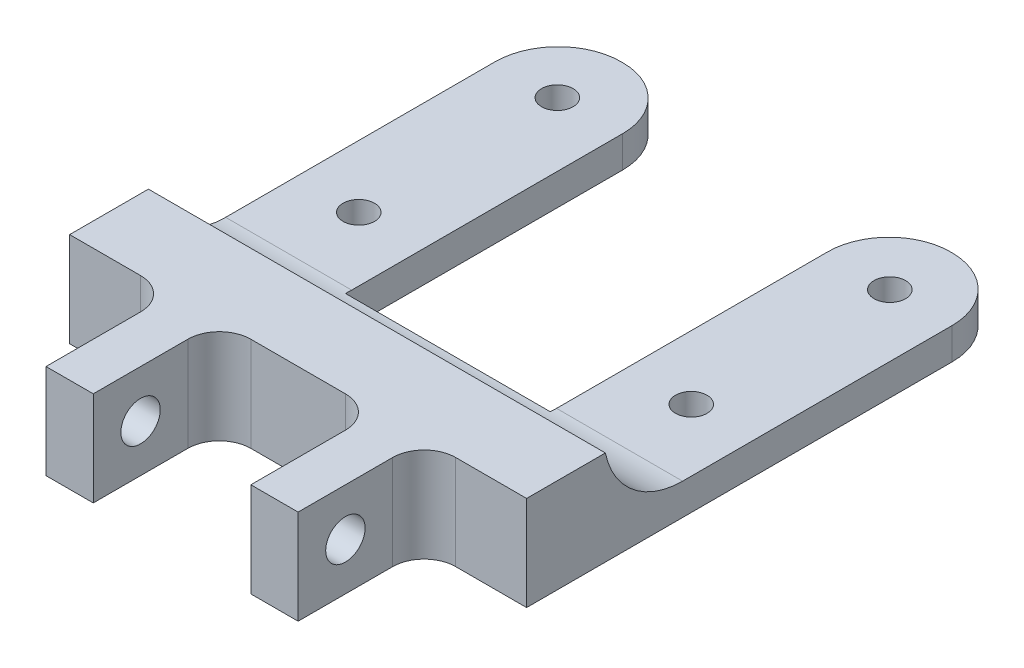
ISO-10303-21;
HEADER;
FILE_DESCRIPTION(('STEP AP214'),'2;1');
FILE_NAME('part.step','',(''),(''),'','','');
FILE_SCHEMA(('AUTOMOTIVE_DESIGN { 1 0 10303 214 1 1 1 1 }'));
ENDSEC;
DATA;
#1=APPLICATION_CONTEXT('core data for automotive mechanical design processes');
#2=APPLICATION_PROTOCOL_DEFINITION('international standard','automotive_design',2000,#1);
#3=PRODUCT_CONTEXT('',#1,'mechanical');
#4=PRODUCT('Part','Part','',(#3));
#5=PRODUCT_RELATED_PRODUCT_CATEGORY('part','',(#4));
#6=PRODUCT_DEFINITION_FORMATION('','',#4);
#7=PRODUCT_DEFINITION_CONTEXT('part definition',#1,'design');
#8=PRODUCT_DEFINITION('design','',#6,#7);
#9=PRODUCT_DEFINITION_SHAPE('','',#8);
#10=(LENGTH_UNIT() NAMED_UNIT(*) SI_UNIT(.MILLI.,.METRE.));
#11=(NAMED_UNIT(*) PLANE_ANGLE_UNIT() SI_UNIT($,.RADIAN.));
#12=(NAMED_UNIT(*) SI_UNIT($,.STERADIAN.) SOLID_ANGLE_UNIT());
#13=UNCERTAINTY_MEASURE_WITH_UNIT(LENGTH_MEASURE(1.E-05),#10,'distance_accuracy_value','');
#14=(GEOMETRIC_REPRESENTATION_CONTEXT(3) GLOBAL_UNCERTAINTY_ASSIGNED_CONTEXT((#13)) GLOBAL_UNIT_ASSIGNED_CONTEXT((#10,
#11,#12)) REPRESENTATION_CONTEXT('',''));
#15=CARTESIAN_POINT('',(0.,0.,0.));
#16=DIRECTION('',(0.,0.,1.));
#17=DIRECTION('',(1.,0.,0.));
#18=AXIS2_PLACEMENT_3D('',#15,#16,#17);
#19=CARTESIAN_POINT('',(0.,0.,5.));
#20=DIRECTION('',(0.,0.,1.));
#21=DIRECTION('',(1.,0.,0.));
#22=AXIS2_PLACEMENT_3D('',#19,#20,#21);
#23=PLANE('',#22);
#24=DIRECTION('',(1.,0.,0.));
#25=VECTOR('',#24,1.);
#26=CARTESIAN_POINT('',(0.,0.,5.));
#27=LINE('',#26,#25);
#28=CARTESIAN_POINT('',(11.5,0.,5.));
#29=VERTEX_POINT('',#28);
#30=CARTESIAN_POINT('',(17.5,0.,5.));
#31=VERTEX_POINT('',#30);
#32=EDGE_CURVE('E284',#29,#31,#27,.T.);
#33=ORIENTED_EDGE('',*,*,#32,.T.);
#34=DIRECTION('',(0.,-1.,0.));
#35=VECTOR('',#34,1.);
#36=CARTESIAN_POINT('',(17.5,0.,5.));
#37=LINE('',#36,#35);
#38=CARTESIAN_POINT('',(17.5,6.,5.));
#39=VERTEX_POINT('',#38);
#40=EDGE_CURVE('E412',#31,#39,#37,.F.);
#41=ORIENTED_EDGE('',*,*,#40,.T.);
#42=DIRECTION('',(1.,0.,0.));
#43=VECTOR('',#42,1.);
#44=CARTESIAN_POINT('',(0.,6.,5.));
#45=LINE('',#44,#43);
#46=CARTESIAN_POINT('',(11.5,6.,5.));
#47=VERTEX_POINT('',#46);
#48=EDGE_CURVE('E275',#47,#39,#45,.T.);
#49=ORIENTED_EDGE('',*,*,#48,.F.);
#50=DIRECTION('',(0.,1.,0.));
#51=VECTOR('',#50,1.);
#52=CARTESIAN_POINT('',(11.5,0.,5.));
#53=LINE('',#52,#51);
#54=EDGE_CURVE('E410',#47,#29,#53,.F.);
#55=ORIENTED_EDGE('',*,*,#54,.T.);
#56=EDGE_LOOP('',(#33,#41,#49,#55));
#57=FACE_BOUND('',#56,.T.);
#58=ADVANCED_FACE('F37',(#57),#23,.T.);
#59=CARTESIAN_POINT('',(24.5,6.,5.));
#60=VERTEX_POINT('',#59);
#61=CARTESIAN_POINT('',(29.,6.,5.));
#62=VERTEX_POINT('',#61);
#63=EDGE_CURVE('E271',#60,#62,#45,.T.);
#64=ORIENTED_EDGE('',*,*,#63,.F.);
#65=DIRECTION('',(0.,1.,0.));
#66=VECTOR('',#65,1.);
#67=CARTESIAN_POINT('',(24.5,0.,5.));
#68=LINE('',#67,#66);
#69=CARTESIAN_POINT('',(24.5,0.,5.));
#70=VERTEX_POINT('',#69);
#71=EDGE_CURVE('E417',#60,#70,#68,.F.);
#72=ORIENTED_EDGE('',*,*,#71,.T.);
#73=CARTESIAN_POINT('',(29.,0.,5.));
#74=VERTEX_POINT('',#73);
#75=EDGE_CURVE('E280',#70,#74,#27,.T.);
#76=ORIENTED_EDGE('',*,*,#75,.T.);
#77=DIRECTION('',(0.,1.,0.));
#78=VECTOR('',#77,1.);
#79=CARTESIAN_POINT('',(29.,0.,5.));
#80=LINE('',#79,#78);
#81=EDGE_CURVE('E285',#74,#62,#80,.T.);
#82=ORIENTED_EDGE('',*,*,#81,.T.);
#83=EDGE_LOOP('',(#64,#72,#76,#82));
#84=FACE_BOUND('',#83,.T.);
#85=ADVANCED_FACE('F465',(#84),#23,.T.);
#86=CARTESIAN_POINT('',(0.,2.,0.));
#87=DIRECTION('',(0.,1.,0.));
#88=DIRECTION('',(0.,0.,1.));
#89=AXIS2_PLACEMENT_3D('',#86,#87,#88);
#90=PLANE('',#89);
#91=CARTESIAN_POINT('',(3.95,2.,-22.));
#92=DIRECTION('',(0.,1.,0.));
#93=DIRECTION('',(0.,0.,1.));
#94=AXIS2_PLACEMENT_3D('',#91,#92,#93);
#95=CIRCLE('',#94,1.);
#96=CARTESIAN_POINT('',(3.95,2.,-21.));
#97=VERTEX_POINT('',#96);
#98=EDGE_CURVE('E327',#97,#97,#95,.T.);
#99=ORIENTED_EDGE('',*,*,#98,.F.);
#100=EDGE_LOOP('',(#99));
#101=FACE_BOUND('',#100,.T.);
#102=CARTESIAN_POINT('',(3.95,2.,-9.4));
#103=DIRECTION('',(0.,1.,0.));
#104=DIRECTION('',(0.,0.,1.));
#105=AXIS2_PLACEMENT_3D('',#102,#103,#104);
#106=CIRCLE('',#105,1.);
#107=CARTESIAN_POINT('',(3.95,2.,-8.4));
#108=VERTEX_POINT('',#107);
#109=EDGE_CURVE('E318',#108,#108,#106,.T.);
#110=ORIENTED_EDGE('',*,*,#109,.F.);
#111=EDGE_LOOP('',(#110));
#112=FACE_BOUND('',#111,.T.);
#113=DIRECTION('',(0.,0.,-1.));
#114=VECTOR('',#113,1.);
#115=CARTESIAN_POINT('',(0.,2.,0.));
#116=LINE('',#115,#114);
#117=CARTESIAN_POINT('',(0.,2.,-4.89897948556636));
#118=VERTEX_POINT('',#117);
#119=CARTESIAN_POINT('',(0.,2.,-22.));
#120=VERTEX_POINT('',#119);
#121=EDGE_CURVE('E300',#118,#120,#116,.T.);
#122=ORIENTED_EDGE('',*,*,#121,.F.);
#123=DIRECTION('',(-1.,0.,0.));
#124=VECTOR('',#123,1.);
#125=CARTESIAN_POINT('',(29.,2.,-4.89897948556636));
#126=LINE('',#125,#124);
#127=CARTESIAN_POINT('',(8.,2.,-4.89897948556636));
#128=VERTEX_POINT('',#127);
#129=EDGE_CURVE('E394',#118,#128,#126,.F.);
#130=ORIENTED_EDGE('',*,*,#129,.T.);
#131=DIRECTION('',(0.,0.,1.));
#132=VECTOR('',#131,1.);
#133=CARTESIAN_POINT('',(8.00000000000001,2.,0.));
#134=LINE('',#133,#132);
#135=CARTESIAN_POINT('',(8.,2.,-22.1));
#136=VERTEX_POINT('',#135);
#137=EDGE_CURVE('E315',#136,#128,#134,.T.);
#138=ORIENTED_EDGE('',*,*,#137,.F.);
#139=CARTESIAN_POINT('',(4.1,2.,-22.1));
#140=DIRECTION('',(0.,1.,0.));
#141=DIRECTION('',(0.,0.,1.));
#142=AXIS2_PLACEMENT_3D('',#139,#140,#141);
#143=CIRCLE('',#142,3.9);
#144=CARTESIAN_POINT('',(4.09999999999997,2.,-26.));
#145=VERTEX_POINT('',#144);
#146=EDGE_CURVE('E290',#145,#136,#143,.F.);
#147=ORIENTED_EDGE('',*,*,#146,.F.);
#148=DIRECTION('',(1.,0.,0.));
#149=VECTOR('',#148,1.);
#150=CARTESIAN_POINT('',(0.,2.,-26.));
#151=LINE('',#150,#149);
#152=CARTESIAN_POINT('',(4.00000000000003,2.,-26.));
#153=VERTEX_POINT('',#152);
#154=EDGE_CURVE('E293',#153,#145,#151,.T.);
#155=ORIENTED_EDGE('',*,*,#154,.F.);
#156=CARTESIAN_POINT('',(4.,2.,-22.));
#157=DIRECTION('',(0.,1.,0.));
#158=DIRECTION('',(0.,0.,1.));
#159=AXIS2_PLACEMENT_3D('',#156,#157,#158);
#160=CIRCLE('',#159,4.);
#161=EDGE_CURVE('E297',#120,#153,#160,.F.);
#162=ORIENTED_EDGE('',*,*,#161,.F.);
#163=EDGE_LOOP('',(#122,#130,#138,#147,#155,#162));
#164=FACE_BOUND('',#163,.T.);
#165=ADVANCED_FACE('F511',(#101,#112,#164),#90,.T.);
#166=CARTESIAN_POINT('',(4.1,2.,-22.1));
#167=DIRECTION('',(0.,-1.,0.));
#168=DIRECTION('',(0.,0.,-1.));
#169=AXIS2_PLACEMENT_3D('',#166,#167,#168);
#170=CYLINDRICAL_SURFACE('',#169,3.9);
#171=CARTESIAN_POINT('',(4.1,0.,-22.1));
#172=DIRECTION('',(0.,1.,0.));
#173=DIRECTION('',(0.,0.,1.));
#174=AXIS2_PLACEMENT_3D('',#171,#172,#173);
#175=CIRCLE('',#174,3.9);
#176=CARTESIAN_POINT('',(4.09999999999997,0.,-26.));
#177=VERTEX_POINT('',#176);
#178=CARTESIAN_POINT('',(8.,0.,-22.1));
#179=VERTEX_POINT('',#178);
#180=EDGE_CURVE('E288',#177,#179,#175,.F.);
#181=ORIENTED_EDGE('',*,*,#180,.F.);
#182=DIRECTION('',(0.,-1.,0.));
#183=VECTOR('',#182,1.);
#184=CARTESIAN_POINT('',(4.09999999999997,2.,-26.));
#185=LINE('',#184,#183);
#186=EDGE_CURVE('E390',#145,#177,#185,.T.);
#187=ORIENTED_EDGE('',*,*,#186,.F.);
#188=ORIENTED_EDGE('',*,*,#146,.T.);
#189=DIRECTION('',(0.,-1.,0.));
#190=VECTOR('',#189,1.);
#191=CARTESIAN_POINT('',(8.,2.,-22.1));
#192=LINE('',#191,#190);
#193=EDGE_CURVE('E330',#136,#179,#192,.T.);
#194=ORIENTED_EDGE('',*,*,#193,.T.);
#195=EDGE_LOOP('',(#181,#187,#188,#194));
#196=FACE_BOUND('',#195,.T.);
#197=ADVANCED_FACE('F577',(#196),#170,.T.);
#198=CARTESIAN_POINT('',(0.,2.,-26.));
#199=DIRECTION('',(0.,0.,-1.));
#200=DIRECTION('',(-1.,0.,0.));
#201=AXIS2_PLACEMENT_3D('',#198,#199,#200);
#202=PLANE('',#201);
#203=DIRECTION('',(1.,0.,0.));
#204=VECTOR('',#203,1.);
#205=CARTESIAN_POINT('',(0.,0.,-26.));
#206=LINE('',#205,#204);
#207=CARTESIAN_POINT('',(4.00000000000003,0.,-26.));
#208=VERTEX_POINT('',#207);
#209=EDGE_CURVE('E332',#208,#177,#206,.T.);
#210=ORIENTED_EDGE('',*,*,#209,.F.);
#211=DIRECTION('',(0.,-1.,0.));
#212=VECTOR('',#211,1.);
#213=CARTESIAN_POINT('',(4.00000000000003,2.,-26.));
#214=LINE('',#213,#212);
#215=EDGE_CURVE('E388',#153,#208,#214,.T.);
#216=ORIENTED_EDGE('',*,*,#215,.F.);
#217=ORIENTED_EDGE('',*,*,#154,.T.);
#218=ORIENTED_EDGE('',*,*,#186,.T.);
#219=EDGE_LOOP('',(#210,#216,#217,#218));
#220=FACE_BOUND('',#219,.T.);
#221=ADVANCED_FACE('F573',(#220),#202,.T.);
#222=CARTESIAN_POINT('',(4.,2.,-22.));
#223=DIRECTION('',(0.,-1.,0.));
#224=DIRECTION('',(0.,0.,-1.));
#225=AXIS2_PLACEMENT_3D('',#222,#223,#224);
#226=CYLINDRICAL_SURFACE('',#225,4.);
#227=CARTESIAN_POINT('',(4.,0.,-22.));
#228=DIRECTION('',(0.,1.,0.));
#229=DIRECTION('',(0.,0.,1.));
#230=AXIS2_PLACEMENT_3D('',#227,#228,#229);
#231=CIRCLE('',#230,4.);
#232=CARTESIAN_POINT('',(0.,0.,-22.));
#233=VERTEX_POINT('',#232);
#234=EDGE_CURVE('E335',#233,#208,#231,.F.);
#235=ORIENTED_EDGE('',*,*,#234,.F.);
#236=DIRECTION('',(0.,-1.,0.));
#237=VECTOR('',#236,1.);
#238=CARTESIAN_POINT('',(0.,2.,-22.));
#239=LINE('',#238,#237);
#240=EDGE_CURVE('E386',#120,#233,#239,.T.);
#241=ORIENTED_EDGE('',*,*,#240,.F.);
#242=ORIENTED_EDGE('',*,*,#161,.T.);
#243=ORIENTED_EDGE('',*,*,#215,.T.);
#244=EDGE_LOOP('',(#235,#241,#242,#243));
#245=FACE_BOUND('',#244,.T.);
#246=ADVANCED_FACE('F570',(#245),#226,.T.);
#247=CARTESIAN_POINT('',(0.,2.,0.));
#248=DIRECTION('',(-1.,0.,0.));
#249=DIRECTION('',(0.,0.,1.));
#250=AXIS2_PLACEMENT_3D('',#247,#248,#249);
#251=PLANE('',#250);
#252=DIRECTION('',(0.,0.,-1.));
#253=VECTOR('',#252,1.);
#254=CARTESIAN_POINT('',(0.,0.,0.));
#255=LINE('',#254,#253);
#256=CARTESIAN_POINT('',(0.,0.,5.));
#257=VERTEX_POINT('',#256);
#258=EDGE_CURVE('E338',#257,#233,#255,.T.);
#259=ORIENTED_EDGE('',*,*,#258,.F.);
#260=DIRECTION('',(0.,1.,0.));
#261=VECTOR('',#260,1.);
#262=CARTESIAN_POINT('',(0.,0.,5.));
#263=LINE('',#262,#261);
#264=CARTESIAN_POINT('',(0.,6.,5.));
#265=VERTEX_POINT('',#264);
#266=EDGE_CURVE('E283',#257,#265,#263,.T.);
#267=ORIENTED_EDGE('',*,*,#266,.T.);
#268=DIRECTION('',(0.,0.,1.));
#269=VECTOR('',#268,1.);
#270=CARTESIAN_POINT('',(0.,6.,0.));
#271=LINE('',#270,#269);
#272=CARTESIAN_POINT('',(0.,6.,0.));
#273=VERTEX_POINT('',#272);
#274=EDGE_CURVE('E268',#273,#265,#271,.T.);
#275=ORIENTED_EDGE('',*,*,#274,.F.);
#276=CARTESIAN_POINT('',(0.,7.,-4.89897948556636));
#277=DIRECTION('',(-1.,0.,0.));
#278=DIRECTION('',(0.,0.,1.));
#279=AXIS2_PLACEMENT_3D('',#276,#277,#278);
#280=CIRCLE('',#279,5.);
#281=EDGE_CURVE('E407',#273,#118,#280,.F.);
#282=ORIENTED_EDGE('',*,*,#281,.T.);
#283=ORIENTED_EDGE('',*,*,#121,.T.);
#284=ORIENTED_EDGE('',*,*,#240,.T.);
#285=EDGE_LOOP('',(#259,#267,#275,#282,#283,#284));
#286=FACE_BOUND('',#285,.T.);
#287=ADVANCED_FACE('F481',(#286),#251,.T.);
#288=CARTESIAN_POINT('',(29.,2.,0.));
#289=DIRECTION('',(-1.,0.,0.));
#290=DIRECTION('',(0.,0.,1.));
#291=AXIS2_PLACEMENT_3D('',#288,#289,#290);
#292=PLANE('',#291);
#293=DIRECTION('',(0.,0.,-1.));
#294=VECTOR('',#293,1.);
#295=CARTESIAN_POINT('',(29.,0.,0.));
#296=LINE('',#295,#294);
#297=CARTESIAN_POINT('',(29.,0.,-22.));
#298=VERTEX_POINT('',#297);
#299=EDGE_CURVE('E341',#74,#298,#296,.T.);
#300=ORIENTED_EDGE('',*,*,#299,.T.);
#301=DIRECTION('',(0.,-1.,0.));
#302=VECTOR('',#301,1.);
#303=CARTESIAN_POINT('',(29.,2.,-22.));
#304=LINE('',#303,#302);
#305=CARTESIAN_POINT('',(29.,2.,-22.));
#306=VERTEX_POINT('',#305);
#307=EDGE_CURVE('E384',#306,#298,#304,.T.);
#308=ORIENTED_EDGE('',*,*,#307,.F.);
#309=DIRECTION('',(0.,0.,-1.));
#310=VECTOR('',#309,1.);
#311=CARTESIAN_POINT('',(29.,2.,0.));
#312=LINE('',#311,#310);
#313=CARTESIAN_POINT('',(29.,2.,-4.89897948556636));
#314=VERTEX_POINT('',#313);
#315=EDGE_CURVE('E302',#314,#306,#312,.T.);
#316=ORIENTED_EDGE('',*,*,#315,.F.);
#317=CARTESIAN_POINT('',(29.,7.,-4.89897948556636));
#318=DIRECTION('',(-1.,0.,0.));
#319=DIRECTION('',(0.,0.,1.));
#320=AXIS2_PLACEMENT_3D('',#317,#318,#319);
#321=CIRCLE('',#320,5.);
#322=CARTESIAN_POINT('',(29.,6.,0.));
#323=VERTEX_POINT('',#322);
#324=EDGE_CURVE('E405',#314,#323,#321,.T.);
#325=ORIENTED_EDGE('',*,*,#324,.T.);
#326=DIRECTION('',(0.,0.,-1.));
#327=VECTOR('',#326,1.);
#328=CARTESIAN_POINT('',(29.,6.,0.));
#329=LINE('',#328,#327);
#330=EDGE_CURVE('E274',#62,#323,#329,.T.);
#331=ORIENTED_EDGE('',*,*,#330,.F.);
#332=ORIENTED_EDGE('',*,*,#81,.F.);
#333=EDGE_LOOP('',(#300,#308,#316,#325,#331,#332));
#334=FACE_BOUND('',#333,.T.);
#335=ADVANCED_FACE('F469',(#334),#292,.F.);
#336=CARTESIAN_POINT('',(25.,2.,-22.));
#337=DIRECTION('',(0.,-1.,0.));
#338=DIRECTION('',(0.,0.,-1.));
#339=AXIS2_PLACEMENT_3D('',#336,#337,#338);
#340=CYLINDRICAL_SURFACE('',#339,4.);
#341=CARTESIAN_POINT('',(25.,0.,-22.));
#342=DIRECTION('',(0.,1.,0.));
#343=DIRECTION('',(0.,0.,1.));
#344=AXIS2_PLACEMENT_3D('',#341,#342,#343);
#345=CIRCLE('',#344,4.);
#346=CARTESIAN_POINT('',(25.,0.,-26.));
#347=VERTEX_POINT('',#346);
#348=EDGE_CURVE('E344',#347,#298,#345,.F.);
#349=ORIENTED_EDGE('',*,*,#348,.F.);
#350=DIRECTION('',(0.,-1.,0.));
#351=VECTOR('',#350,1.);
#352=CARTESIAN_POINT('',(25.,2.,-26.));
#353=LINE('',#352,#351);
#354=CARTESIAN_POINT('',(25.,2.,-26.));
#355=VERTEX_POINT('',#354);
#356=EDGE_CURVE('E382',#355,#347,#353,.T.);
#357=ORIENTED_EDGE('',*,*,#356,.F.);
#358=CARTESIAN_POINT('',(25.,2.,-22.));
#359=DIRECTION('',(0.,1.,0.));
#360=DIRECTION('',(0.,0.,1.));
#361=AXIS2_PLACEMENT_3D('',#358,#359,#360);
#362=CIRCLE('',#361,4.);
#363=EDGE_CURVE('E304',#355,#306,#362,.F.);
#364=ORIENTED_EDGE('',*,*,#363,.T.);
#365=ORIENTED_EDGE('',*,*,#307,.T.);
#366=EDGE_LOOP('',(#349,#357,#364,#365));
#367=FACE_BOUND('',#366,.T.);
#368=ADVANCED_FACE('F561',(#367),#340,.T.);
#369=CARTESIAN_POINT('',(0.,2.,-26.));
#370=DIRECTION('',(0.,0.,-1.));
#371=DIRECTION('',(-1.,0.,0.));
#372=AXIS2_PLACEMENT_3D('',#369,#370,#371);
#373=PLANE('',#372);
#374=DIRECTION('',(1.,0.,0.));
#375=VECTOR('',#374,1.);
#376=CARTESIAN_POINT('',(0.,0.,-26.));
#377=LINE('',#376,#375);
#378=CARTESIAN_POINT('',(24.9,0.,-26.));
#379=VERTEX_POINT('',#378);
#380=EDGE_CURVE('E347',#379,#347,#377,.T.);
#381=ORIENTED_EDGE('',*,*,#380,.F.);
#382=DIRECTION('',(0.,-1.,0.));
#383=VECTOR('',#382,1.);
#384=CARTESIAN_POINT('',(24.9,2.,-26.));
#385=LINE('',#384,#383);
#386=CARTESIAN_POINT('',(24.9,2.,-26.));
#387=VERTEX_POINT('',#386);
#388=EDGE_CURVE('E380',#387,#379,#385,.T.);
#389=ORIENTED_EDGE('',*,*,#388,.F.);
#390=DIRECTION('',(1.,0.,0.));
#391=VECTOR('',#390,1.);
#392=CARTESIAN_POINT('',(0.,2.,-26.));
#393=LINE('',#392,#391);
#394=EDGE_CURVE('E307',#387,#355,#393,.T.);
#395=ORIENTED_EDGE('',*,*,#394,.T.);
#396=ORIENTED_EDGE('',*,*,#356,.T.);
#397=EDGE_LOOP('',(#381,#389,#395,#396));
#398=FACE_BOUND('',#397,.T.);
#399=ADVANCED_FACE('F557',(#398),#373,.T.);
#400=CARTESIAN_POINT('',(24.9,2.,-22.1));
#401=DIRECTION('',(0.,-1.,0.));
#402=DIRECTION('',(0.,0.,-1.));
#403=AXIS2_PLACEMENT_3D('',#400,#401,#402);
#404=CYLINDRICAL_SURFACE('',#403,3.9);
#405=CARTESIAN_POINT('',(24.9,0.,-22.1));
#406=DIRECTION('',(0.,1.,0.));
#407=DIRECTION('',(0.,0.,1.));
#408=AXIS2_PLACEMENT_3D('',#405,#406,#407);
#409=CIRCLE('',#408,3.9);
#410=CARTESIAN_POINT('',(21.,0.,-22.1));
#411=VERTEX_POINT('',#410);
#412=EDGE_CURVE('E350',#379,#411,#409,.T.);
#413=ORIENTED_EDGE('',*,*,#412,.T.);
#414=DIRECTION('',(0.,-1.,0.));
#415=VECTOR('',#414,1.);
#416=CARTESIAN_POINT('',(21.,2.,-22.1));
#417=LINE('',#416,#415);
#418=CARTESIAN_POINT('',(21.,2.,-22.1));
#419=VERTEX_POINT('',#418);
#420=EDGE_CURVE('E377',#419,#411,#417,.T.);
#421=ORIENTED_EDGE('',*,*,#420,.F.);
#422=CARTESIAN_POINT('',(24.9,2.,-22.1));
#423=DIRECTION('',(0.,1.,0.));
#424=DIRECTION('',(0.,0.,1.));
#425=AXIS2_PLACEMENT_3D('',#422,#423,#424);
#426=CIRCLE('',#425,3.9);
#427=EDGE_CURVE('E310',#387,#419,#426,.T.);
#428=ORIENTED_EDGE('',*,*,#427,.F.);
#429=ORIENTED_EDGE('',*,*,#388,.T.);
#430=EDGE_LOOP('',(#413,#421,#428,#429));
#431=FACE_BOUND('',#430,.T.);
#432=ADVANCED_FACE('F553',(#431),#404,.T.);
#433=CARTESIAN_POINT('',(21.,2.,0.));
#434=DIRECTION('',(1.,0.,0.));
#435=DIRECTION('',(0.,0.,-1.));
#436=AXIS2_PLACEMENT_3D('',#433,#434,#435);
#437=PLANE('',#436);
#438=DIRECTION('',(0.,0.,1.));
#439=VECTOR('',#438,1.);
#440=CARTESIAN_POINT('',(21.,0.,0.));
#441=LINE('',#440,#439);
#442=CARTESIAN_POINT('',(21.,0.,-4.5));
#443=VERTEX_POINT('',#442);
#444=EDGE_CURVE('E352',#411,#443,#441,.T.);
#445=ORIENTED_EDGE('',*,*,#444,.T.);
#446=DIRECTION('',(0.,-1.,0.));
#447=VECTOR('',#446,1.);
#448=CARTESIAN_POINT('',(21.,2.,-4.5));
#449=LINE('',#448,#447);
#450=CARTESIAN_POINT('',(21.,2.01594388373313,-4.5));
#451=VERTEX_POINT('',#450);
#452=EDGE_CURVE('E375',#451,#443,#449,.T.);
#453=ORIENTED_EDGE('',*,*,#452,.F.);
#454=CARTESIAN_POINT('',(21.,7.,-4.89897948556636));
#455=DIRECTION('',(1.,0.,0.));
#456=DIRECTION('',(0.,0.,-1.));
#457=AXIS2_PLACEMENT_3D('',#454,#455,#456);
#458=CIRCLE('',#457,5.);
#459=CARTESIAN_POINT('',(21.,2.,-4.89897948556636));
#460=VERTEX_POINT('',#459);
#461=EDGE_CURVE('E403',#451,#460,#458,.T.);
#462=ORIENTED_EDGE('',*,*,#461,.T.);
#463=DIRECTION('',(0.,0.,1.));
#464=VECTOR('',#463,1.);
#465=CARTESIAN_POINT('',(21.,2.,0.));
#466=LINE('',#465,#464);
#467=EDGE_CURVE('E312',#419,#460,#466,.T.);
#468=ORIENTED_EDGE('',*,*,#467,.F.);
#469=ORIENTED_EDGE('',*,*,#420,.T.);
#470=EDGE_LOOP('',(#445,#453,#462,#468,#469));
#471=FACE_BOUND('',#470,.T.);
#472=ADVANCED_FACE('F549',(#471),#437,.F.);
#473=CARTESIAN_POINT('',(0.,2.,-4.5));
#474=DIRECTION('',(0.,0.,-1.));
#475=DIRECTION('',(-1.,0.,0.));
#476=AXIS2_PLACEMENT_3D('',#473,#474,#475);
#477=PLANE('',#476);
#478=DIRECTION('',(1.,0.,0.));
#479=VECTOR('',#478,1.);
#480=CARTESIAN_POINT('',(0.,0.,-4.5));
#481=LINE('',#480,#479);
#482=CARTESIAN_POINT('',(8.,0.,-4.5));
#483=VERTEX_POINT('',#482);
#484=EDGE_CURVE('E355',#483,#443,#481,.T.);
#485=ORIENTED_EDGE('',*,*,#484,.F.);
#486=DIRECTION('',(0.,-1.,0.));
#487=VECTOR('',#486,1.);
#488=CARTESIAN_POINT('',(8.,2.,-4.5));
#489=LINE('',#488,#487);
#490=CARTESIAN_POINT('',(8.,2.01594388373313,-4.5));
#491=VERTEX_POINT('',#490);
#492=EDGE_CURVE('E373',#491,#483,#489,.T.);
#493=ORIENTED_EDGE('',*,*,#492,.F.);
#494=DIRECTION('',(1.,0.,0.));
#495=VECTOR('',#494,1.);
#496=CARTESIAN_POINT('',(8.,2.01594388373313,-4.5));
#497=LINE('',#496,#495);
#498=EDGE_CURVE('E400',#491,#451,#497,.T.);
#499=ORIENTED_EDGE('',*,*,#498,.T.);
#500=ORIENTED_EDGE('',*,*,#452,.T.);
#501=EDGE_LOOP('',(#485,#493,#499,#500));
#502=FACE_BOUND('',#501,.T.);
#503=ADVANCED_FACE('F535',(#502),#477,.T.);
#504=CARTESIAN_POINT('',(25.05,2.,-22.));
#505=DIRECTION('',(0.,-1.,0.));
#506=DIRECTION('',(0.,0.,-1.));
#507=AXIS2_PLACEMENT_3D('',#504,#505,#506);
#508=CYLINDRICAL_SURFACE('',#507,1.);
#509=CARTESIAN_POINT('',(25.05,2.,-22.));
#510=DIRECTION('',(0.,1.,0.));
#511=DIRECTION('',(0.,0.,1.));
#512=AXIS2_PLACEMENT_3D('',#509,#510,#511);
#513=CIRCLE('',#512,1.);
#514=CARTESIAN_POINT('',(25.05,2.,-21.));
#515=VERTEX_POINT('',#514);
#516=EDGE_CURVE('E324',#515,#515,#513,.T.);
#517=ORIENTED_EDGE('',*,*,#516,.T.);
#518=EDGE_LOOP('',(#517));
#519=FACE_BOUND('',#518,.T.);
#520=CARTESIAN_POINT('',(25.05,0.,-22.));
#521=DIRECTION('',(0.,1.,0.));
#522=DIRECTION('',(0.,0.,1.));
#523=AXIS2_PLACEMENT_3D('',#520,#521,#522);
#524=CIRCLE('',#523,1.);
#525=CARTESIAN_POINT('',(25.05,0.,-21.));
#526=VERTEX_POINT('',#525);
#527=EDGE_CURVE('E367',#526,#526,#524,.T.);
#528=ORIENTED_EDGE('',*,*,#527,.F.);
#529=EDGE_LOOP('',(#528));
#530=FACE_BOUND('',#529,.T.);
#531=ADVANCED_FACE('F531',(#519,#530),#508,.F.);
#532=CARTESIAN_POINT('',(25.05,2.,-9.4));
#533=DIRECTION('',(0.,-1.,0.));
#534=DIRECTION('',(0.,0.,-1.));
#535=AXIS2_PLACEMENT_3D('',#532,#533,#534);
#536=CYLINDRICAL_SURFACE('',#535,1.);
#537=CARTESIAN_POINT('',(25.05,2.,-9.4));
#538=DIRECTION('',(0.,1.,0.));
#539=DIRECTION('',(0.,0.,1.));
#540=AXIS2_PLACEMENT_3D('',#537,#538,#539);
#541=CIRCLE('',#540,1.);
#542=CARTESIAN_POINT('',(25.05,2.,-8.4));
#543=VERTEX_POINT('',#542);
#544=EDGE_CURVE('E321',#543,#543,#541,.T.);
#545=ORIENTED_EDGE('',*,*,#544,.T.);
#546=EDGE_LOOP('',(#545));
#547=FACE_BOUND('',#546,.T.);
#548=CARTESIAN_POINT('',(25.05,0.,-9.4));
#549=DIRECTION('',(0.,1.,0.));
#550=DIRECTION('',(0.,0.,1.));
#551=AXIS2_PLACEMENT_3D('',#548,#549,#550);
#552=CIRCLE('',#551,1.);
#553=CARTESIAN_POINT('',(25.05,0.,-8.4));
#554=VERTEX_POINT('',#553);
#555=EDGE_CURVE('E364',#554,#554,#552,.T.);
#556=ORIENTED_EDGE('',*,*,#555,.F.);
#557=EDGE_LOOP('',(#556));
#558=FACE_BOUND('',#557,.T.);
#559=ADVANCED_FACE('F534',(#547,#558),#536,.F.);
#560=CARTESIAN_POINT('',(3.95,2.,-9.4));
#561=DIRECTION('',(0.,-1.,0.));
#562=DIRECTION('',(0.,0.,-1.));
#563=AXIS2_PLACEMENT_3D('',#560,#561,#562);
#564=CYLINDRICAL_SURFACE('',#563,1.);
#565=ORIENTED_EDGE('',*,*,#109,.T.);
#566=EDGE_LOOP('',(#565));
#567=FACE_BOUND('',#566,.T.);
#568=CARTESIAN_POINT('',(3.95,0.,-9.4));
#569=DIRECTION('',(0.,1.,0.));
#570=DIRECTION('',(0.,0.,1.));
#571=AXIS2_PLACEMENT_3D('',#568,#569,#570);
#572=CIRCLE('',#571,1.);
#573=CARTESIAN_POINT('',(3.95,0.,-8.4));
#574=VERTEX_POINT('',#573);
#575=EDGE_CURVE('E361',#574,#574,#572,.T.);
#576=ORIENTED_EDGE('',*,*,#575,.F.);
#577=EDGE_LOOP('',(#576));
#578=FACE_BOUND('',#577,.T.);
#579=ADVANCED_FACE('F539',(#567,#578),#564,.F.);
#580=CARTESIAN_POINT('',(8.00000000000001,2.,0.));
#581=DIRECTION('',(1.,0.,0.));
#582=DIRECTION('',(0.,0.,-1.));
#583=AXIS2_PLACEMENT_3D('',#580,#581,#582);
#584=PLANE('',#583);
#585=DIRECTION('',(0.,0.,1.));
#586=VECTOR('',#585,1.);
#587=CARTESIAN_POINT('',(8.00000000000001,0.,0.));
#588=LINE('',#587,#586);
#589=EDGE_CURVE('E358',#179,#483,#588,.T.);
#590=ORIENTED_EDGE('',*,*,#589,.F.);
#591=ORIENTED_EDGE('',*,*,#193,.F.);
#592=ORIENTED_EDGE('',*,*,#137,.T.);
#593=CARTESIAN_POINT('',(8.,7.,-4.89897948556636));
#594=DIRECTION('',(1.,0.,0.));
#595=DIRECTION('',(0.,0.,-1.));
#596=AXIS2_PLACEMENT_3D('',#593,#594,#595);
#597=CIRCLE('',#596,5.);
#598=EDGE_CURVE('E397',#128,#491,#597,.F.);
#599=ORIENTED_EDGE('',*,*,#598,.T.);
#600=ORIENTED_EDGE('',*,*,#492,.T.);
#601=EDGE_LOOP('',(#590,#591,#592,#599,#600));
#602=FACE_BOUND('',#601,.T.);
#603=ADVANCED_FACE('F529',(#602),#584,.T.);
#604=CARTESIAN_POINT('',(3.95,2.,-22.));
#605=DIRECTION('',(0.,-1.,0.));
#606=DIRECTION('',(0.,0.,-1.));
#607=AXIS2_PLACEMENT_3D('',#604,#605,#606);
#608=CYLINDRICAL_SURFACE('',#607,1.);
#609=ORIENTED_EDGE('',*,*,#98,.T.);
#610=EDGE_LOOP('',(#609));
#611=FACE_BOUND('',#610,.T.);
#612=CARTESIAN_POINT('',(3.95,0.,-22.));
#613=DIRECTION('',(0.,1.,0.));
#614=DIRECTION('',(0.,0.,1.));
#615=AXIS2_PLACEMENT_3D('',#612,#613,#614);
#616=CIRCLE('',#615,1.);
#617=CARTESIAN_POINT('',(3.95,0.,-21.));
#618=VERTEX_POINT('',#617);
#619=EDGE_CURVE('E294',#618,#618,#616,.T.);
#620=ORIENTED_EDGE('',*,*,#619,.F.);
#621=EDGE_LOOP('',(#620));
#622=FACE_BOUND('',#621,.T.);
#623=ADVANCED_FACE('F524',(#611,#622),#608,.F.);
#624=ORIENTED_EDGE('',*,*,#467,.T.);
#625=DIRECTION('',(-1.,0.,0.));
#626=VECTOR('',#625,1.);
#627=CARTESIAN_POINT('',(29.,2.,-4.89897948556636));
#628=LINE('',#627,#626);
#629=EDGE_CURVE('E392',#460,#314,#628,.F.);
#630=ORIENTED_EDGE('',*,*,#629,.T.);
#631=ORIENTED_EDGE('',*,*,#315,.T.);
#632=ORIENTED_EDGE('',*,*,#363,.F.);
#633=ORIENTED_EDGE('',*,*,#394,.F.);
#634=ORIENTED_EDGE('',*,*,#427,.T.);
#635=EDGE_LOOP('',(#624,#630,#631,#632,#633,#634));
#636=FACE_BOUND('',#635,.T.);
#637=ORIENTED_EDGE('',*,*,#544,.F.);
#638=EDGE_LOOP('',(#637));
#639=FACE_BOUND('',#638,.T.);
#640=ORIENTED_EDGE('',*,*,#516,.F.);
#641=EDGE_LOOP('',(#640));
#642=FACE_BOUND('',#641,.T.);
#643=ADVANCED_FACE('F519',(#636,#639,#642),#90,.T.);
#644=CARTESIAN_POINT('',(0.,0.,0.));
#645=DIRECTION('',(0.,1.,0.));
#646=DIRECTION('',(0.,0.,1.));
#647=AXIS2_PLACEMENT_3D('',#644,#645,#646);
#648=PLANE('',#647);
#649=ORIENTED_EDGE('',*,*,#180,.T.);
#650=ORIENTED_EDGE('',*,*,#589,.T.);
#651=ORIENTED_EDGE('',*,*,#484,.T.);
#652=ORIENTED_EDGE('',*,*,#444,.F.);
#653=ORIENTED_EDGE('',*,*,#412,.F.);
#654=ORIENTED_EDGE('',*,*,#380,.T.);
#655=ORIENTED_EDGE('',*,*,#348,.T.);
#656=ORIENTED_EDGE('',*,*,#299,.F.);
#657=ORIENTED_EDGE('',*,*,#75,.F.);
#658=CARTESIAN_POINT('',(24.5,0.,7.));
#659=DIRECTION('',(0.,1.,0.));
#660=DIRECTION('',(0.,0.,1.));
#661=AXIS2_PLACEMENT_3D('',#658,#659,#660);
#662=CIRCLE('',#661,2.);
#663=CARTESIAN_POINT('',(22.5,0.,7.));
#664=VERTEX_POINT('',#663);
#665=EDGE_CURVE('E432',#70,#664,#662,.T.);
#666=ORIENTED_EDGE('',*,*,#665,.T.);
#667=DIRECTION('',(0.,0.,-1.));
#668=VECTOR('',#667,1.);
#669=CARTESIAN_POINT('',(22.5,0.,13.));
#670=LINE('',#669,#668);
#671=CARTESIAN_POINT('',(22.5,0.,13.));
#672=VERTEX_POINT('',#671);
#673=EDGE_CURVE('E224',#672,#664,#670,.T.);
#674=ORIENTED_EDGE('',*,*,#673,.F.);
#675=DIRECTION('',(1.,0.,0.));
#676=VECTOR('',#675,1.);
#677=CARTESIAN_POINT('',(19.5,0.,13.));
#678=LINE('',#677,#676);
#679=CARTESIAN_POINT('',(19.5,0.,13.));
#680=VERTEX_POINT('',#679);
#681=EDGE_CURVE('E216',#680,#672,#678,.T.);
#682=ORIENTED_EDGE('',*,*,#681,.F.);
#683=DIRECTION('',(0.,0.,-1.));
#684=VECTOR('',#683,1.);
#685=CARTESIAN_POINT('',(19.5,0.,13.));
#686=LINE('',#685,#684);
#687=CARTESIAN_POINT('',(19.5,0.,7.));
#688=VERTEX_POINT('',#687);
#689=EDGE_CURVE('E222',#680,#688,#686,.T.);
#690=ORIENTED_EDGE('',*,*,#689,.T.);
#691=CARTESIAN_POINT('',(17.5,0.,7.));
#692=DIRECTION('',(0.,1.,0.));
#693=DIRECTION('',(0.,0.,1.));
#694=AXIS2_PLACEMENT_3D('',#691,#692,#693);
#695=CIRCLE('',#694,2.);
#696=EDGE_CURVE('E426',#688,#31,#695,.T.);
#697=ORIENTED_EDGE('',*,*,#696,.T.);
#698=ORIENTED_EDGE('',*,*,#32,.F.);
#699=CARTESIAN_POINT('',(11.5,0.,7.));
#700=DIRECTION('',(0.,1.,0.));
#701=DIRECTION('',(0.,0.,1.));
#702=AXIS2_PLACEMENT_3D('',#699,#700,#701);
#703=CIRCLE('',#702,2.);
#704=CARTESIAN_POINT('',(9.5,0.,7.));
#705=VERTEX_POINT('',#704);
#706=EDGE_CURVE('E436',#29,#705,#703,.T.);
#707=ORIENTED_EDGE('',*,*,#706,.T.);
#708=DIRECTION('',(0.,0.,-1.));
#709=VECTOR('',#708,1.);
#710=CARTESIAN_POINT('',(9.5,0.,13.));
#711=LINE('',#710,#709);
#712=CARTESIAN_POINT('',(9.5,0.,13.));
#713=VERTEX_POINT('',#712);
#714=EDGE_CURVE('E257',#713,#705,#711,.T.);
#715=ORIENTED_EDGE('',*,*,#714,.F.);
#716=DIRECTION('',(1.,0.,0.));
#717=VECTOR('',#716,1.);
#718=CARTESIAN_POINT('',(9.5,0.,13.));
#719=LINE('',#718,#717);
#720=CARTESIAN_POINT('',(6.5,0.,13.));
#721=VERTEX_POINT('',#720);
#722=EDGE_CURVE('E255',#721,#713,#719,.T.);
#723=ORIENTED_EDGE('',*,*,#722,.F.);
#724=DIRECTION('',(0.,0.,-1.));
#725=VECTOR('',#724,1.);
#726=CARTESIAN_POINT('',(6.5,0.,13.));
#727=LINE('',#726,#725);
#728=CARTESIAN_POINT('',(6.5,0.,7.));
#729=VERTEX_POINT('',#728);
#730=EDGE_CURVE('E260',#721,#729,#727,.T.);
#731=ORIENTED_EDGE('',*,*,#730,.T.);
#732=CARTESIAN_POINT('',(4.5,0.,7.));
#733=DIRECTION('',(0.,1.,0.));
#734=DIRECTION('',(0.,0.,1.));
#735=AXIS2_PLACEMENT_3D('',#732,#733,#734);
#736=CIRCLE('',#735,2.);
#737=CARTESIAN_POINT('',(4.5,0.,5.));
#738=VERTEX_POINT('',#737);
#739=EDGE_CURVE('E46',#729,#738,#736,.T.);
#740=ORIENTED_EDGE('',*,*,#739,.T.);
#741=EDGE_CURVE('E281',#257,#738,#27,.T.);
#742=ORIENTED_EDGE('',*,*,#741,.F.);
#743=ORIENTED_EDGE('',*,*,#258,.T.);
#744=ORIENTED_EDGE('',*,*,#234,.T.);
#745=ORIENTED_EDGE('',*,*,#209,.T.);
#746=EDGE_LOOP('',(#649,#650,#651,#652,#653,#654,#655,#656,#657,#666,#674,#682,#690,#697,#698,
#707,#715,#723,#731,#740,#742,#743,#744,#745));
#747=FACE_BOUND('',#746,.T.);
#748=ORIENTED_EDGE('',*,*,#575,.T.);
#749=EDGE_LOOP('',(#748));
#750=FACE_BOUND('',#749,.T.);
#751=ORIENTED_EDGE('',*,*,#555,.T.);
#752=EDGE_LOOP('',(#751));
#753=FACE_BOUND('',#752,.T.);
#754=ORIENTED_EDGE('',*,*,#527,.T.);
#755=EDGE_LOOP('',(#754));
#756=FACE_BOUND('',#755,.T.);
#757=ORIENTED_EDGE('',*,*,#619,.T.);
#758=EDGE_LOOP('',(#757));
#759=FACE_BOUND('',#758,.T.);
#760=ADVANCED_FACE('F219',(#747,#750,#753,#756,#759),#648,.F.);
#761=ORIENTED_EDGE('',*,*,#741,.T.);
#762=DIRECTION('',(0.,-1.,0.));
#763=VECTOR('',#762,1.);
#764=CARTESIAN_POINT('',(4.5,0.,5.));
#765=LINE('',#764,#763);
#766=CARTESIAN_POINT('',(4.5,6.,5.));
#767=VERTEX_POINT('',#766);
#768=EDGE_CURVE('E59',#738,#767,#765,.F.);
#769=ORIENTED_EDGE('',*,*,#768,.T.);
#770=EDGE_CURVE('E272',#265,#767,#45,.T.);
#771=ORIENTED_EDGE('',*,*,#770,.F.);
#772=ORIENTED_EDGE('',*,*,#266,.F.);
#773=EDGE_LOOP('',(#761,#769,#771,#772));
#774=FACE_BOUND('',#773,.T.);
#775=ADVANCED_FACE('F484',(#774),#23,.T.);
#776=CARTESIAN_POINT('',(0.,6.,0.));
#777=DIRECTION('',(0.,1.,0.));
#778=DIRECTION('',(0.,0.,1.));
#779=AXIS2_PLACEMENT_3D('',#776,#777,#778);
#780=PLANE('',#779);
#781=ORIENTED_EDGE('',*,*,#274,.T.);
#782=ORIENTED_EDGE('',*,*,#770,.T.);
#783=CARTESIAN_POINT('',(4.5,6.,7.));
#784=DIRECTION('',(0.,1.,0.));
#785=DIRECTION('',(0.,0.,1.));
#786=AXIS2_PLACEMENT_3D('',#783,#784,#785);
#787=CIRCLE('',#786,2.);
#788=CARTESIAN_POINT('',(6.5,6.,7.));
#789=VERTEX_POINT('',#788);
#790=EDGE_CURVE('E11',#767,#789,#787,.F.);
#791=ORIENTED_EDGE('',*,*,#790,.T.);
#792=DIRECTION('',(0.,0.,-1.));
#793=VECTOR('',#792,1.);
#794=CARTESIAN_POINT('',(6.5,6.,13.));
#795=LINE('',#794,#793);
#796=CARTESIAN_POINT('',(6.5,6.,13.));
#797=VERTEX_POINT('',#796);
#798=EDGE_CURVE('E262',#797,#789,#795,.T.);
#799=ORIENTED_EDGE('',*,*,#798,.F.);
#800=DIRECTION('',(-1.,0.,0.));
#801=VECTOR('',#800,1.);
#802=CARTESIAN_POINT('',(9.5,6.,13.));
#803=LINE('',#802,#801);
#804=CARTESIAN_POINT('',(9.5,6.,13.));
#805=VERTEX_POINT('',#804);
#806=EDGE_CURVE('E246',#805,#797,#803,.T.);
#807=ORIENTED_EDGE('',*,*,#806,.F.);
#808=DIRECTION('',(0.,0.,-1.));
#809=VECTOR('',#808,1.);
#810=CARTESIAN_POINT('',(9.5,6.,13.));
#811=LINE('',#810,#809);
#812=CARTESIAN_POINT('',(9.5,6.,7.));
#813=VERTEX_POINT('',#812);
#814=EDGE_CURVE('E265',#805,#813,#811,.T.);
#815=ORIENTED_EDGE('',*,*,#814,.T.);
#816=CARTESIAN_POINT('',(11.5,6.,7.));
#817=DIRECTION('',(0.,1.,0.));
#818=DIRECTION('',(0.,0.,1.));
#819=AXIS2_PLACEMENT_3D('',#816,#817,#818);
#820=CIRCLE('',#819,2.);
#821=EDGE_CURVE('E434',#813,#47,#820,.F.);
#822=ORIENTED_EDGE('',*,*,#821,.T.);
#823=ORIENTED_EDGE('',*,*,#48,.T.);
#824=CARTESIAN_POINT('',(17.5,6.,7.));
#825=DIRECTION('',(0.,1.,0.));
#826=DIRECTION('',(0.,0.,1.));
#827=AXIS2_PLACEMENT_3D('',#824,#825,#826);
#828=CIRCLE('',#827,2.);
#829=CARTESIAN_POINT('',(19.5,6.,7.));
#830=VERTEX_POINT('',#829);
#831=EDGE_CURVE('E428',#39,#830,#828,.F.);
#832=ORIENTED_EDGE('',*,*,#831,.T.);
#833=DIRECTION('',(0.,0.,-1.));
#834=VECTOR('',#833,1.);
#835=CARTESIAN_POINT('',(19.5,6.,13.));
#836=LINE('',#835,#834);
#837=CARTESIAN_POINT('',(19.5,6.,13.));
#838=VERTEX_POINT('',#837);
#839=EDGE_CURVE('E620',#838,#830,#836,.T.);
#840=ORIENTED_EDGE('',*,*,#839,.F.);
#841=DIRECTION('',(-1.,0.,0.));
#842=VECTOR('',#841,1.);
#843=CARTESIAN_POINT('',(19.5,6.,13.));
#844=LINE('',#843,#842);
#845=CARTESIAN_POINT('',(22.5,6.,13.));
#846=VERTEX_POINT('',#845);
#847=EDGE_CURVE('E233',#846,#838,#844,.T.);
#848=ORIENTED_EDGE('',*,*,#847,.F.);
#849=DIRECTION('',(0.,0.,-1.));
#850=VECTOR('',#849,1.);
#851=CARTESIAN_POINT('',(22.5,6.,13.));
#852=LINE('',#851,#850);
#853=CARTESIAN_POINT('',(22.5,6.,7.));
#854=VERTEX_POINT('',#853);
#855=EDGE_CURVE('E248',#846,#854,#852,.T.);
#856=ORIENTED_EDGE('',*,*,#855,.T.);
#857=CARTESIAN_POINT('',(24.5,6.,7.));
#858=DIRECTION('',(0.,1.,0.));
#859=DIRECTION('',(0.,0.,1.));
#860=AXIS2_PLACEMENT_3D('',#857,#858,#859);
#861=CIRCLE('',#860,2.);
#862=EDGE_CURVE('E430',#854,#60,#861,.F.);
#863=ORIENTED_EDGE('',*,*,#862,.T.);
#864=ORIENTED_EDGE('',*,*,#63,.T.);
#865=ORIENTED_EDGE('',*,*,#330,.T.);
#866=DIRECTION('',(-1.,0.,0.));
#867=VECTOR('',#866,1.);
#868=CARTESIAN_POINT('',(0.,6.,0.));
#869=LINE('',#868,#867);
#870=EDGE_CURVE('E278',#323,#273,#869,.T.);
#871=ORIENTED_EDGE('',*,*,#870,.T.);
#872=EDGE_LOOP('',(#781,#782,#791,#799,#807,#815,#822,#823,#832,#840,#848,#856,#863,#864,#865,#871));
#873=FACE_BOUND('',#872,.T.);
#874=ADVANCED_FACE('F454',(#873),#780,.T.);
#875=CARTESIAN_POINT('',(0.,7.,-4.89897948556636));
#876=DIRECTION('',(1.,0.,0.));
#877=DIRECTION('',(0.,0.,-1.));
#878=AXIS2_PLACEMENT_3D('',#875,#876,#877);
#879=CYLINDRICAL_SURFACE('',#878,5.);
#880=ORIENTED_EDGE('',*,*,#281,.F.);
#881=ORIENTED_EDGE('',*,*,#870,.F.);
#882=ORIENTED_EDGE('',*,*,#324,.F.);
#883=ORIENTED_EDGE('',*,*,#629,.F.);
#884=ORIENTED_EDGE('',*,*,#461,.F.);
#885=ORIENTED_EDGE('',*,*,#498,.F.);
#886=ORIENTED_EDGE('',*,*,#598,.F.);
#887=ORIENTED_EDGE('',*,*,#129,.F.);
#888=EDGE_LOOP('',(#880,#881,#882,#883,#884,#885,#886,#887));
#889=FACE_BOUND('',#888,.T.);
#890=ADVANCED_FACE('F476',(#889),#879,.F.);
#891=CARTESIAN_POINT('',(9.5,6.,13.));
#892=DIRECTION('',(-1.,0.,0.));
#893=DIRECTION('',(0.,0.,1.));
#894=AXIS2_PLACEMENT_3D('',#891,#892,#893);
#895=PLANE('',#894);
#896=CARTESIAN_POINT('',(9.5,3.,10.));
#897=DIRECTION('',(-1.,0.,0.));
#898=DIRECTION('',(0.,0.,1.));
#899=AXIS2_PLACEMENT_3D('',#896,#897,#898);
#900=CIRCLE('',#899,1.25);
#901=CARTESIAN_POINT('',(9.5,3.,11.25));
#902=VERTEX_POINT('',#901);
#903=EDGE_CURVE('E237',#902,#902,#900,.F.);
#904=ORIENTED_EDGE('',*,*,#903,.F.);
#905=EDGE_LOOP('',(#904));
#906=FACE_BOUND('',#905,.T.);
#907=ORIENTED_EDGE('',*,*,#714,.T.);
#908=DIRECTION('',(0.,1.,0.));
#909=VECTOR('',#908,1.);
#910=CARTESIAN_POINT('',(9.5,6.,7.));
#911=LINE('',#910,#909);
#912=EDGE_CURVE('E419',#705,#813,#911,.T.);
#913=ORIENTED_EDGE('',*,*,#912,.T.);
#914=ORIENTED_EDGE('',*,*,#814,.F.);
#915=DIRECTION('',(0.,1.,0.));
#916=VECTOR('',#915,1.);
#917=CARTESIAN_POINT('',(9.5,6.,13.));
#918=LINE('',#917,#916);
#919=EDGE_CURVE('E243',#713,#805,#918,.T.);
#920=ORIENTED_EDGE('',*,*,#919,.F.);
#921=EDGE_LOOP('',(#907,#913,#914,#920));
#922=FACE_BOUND('',#921,.T.);
#923=ADVANCED_FACE('F448',(#906,#922),#895,.F.);
#924=CARTESIAN_POINT('',(6.5,6.,13.));
#925=DIRECTION('',(1.,0.,0.));
#926=DIRECTION('',(0.,1.,0.));
#927=AXIS2_PLACEMENT_3D('',#924,#925,#926);
#928=PLANE('',#927);
#929=CARTESIAN_POINT('',(6.5,3.,10.));
#930=DIRECTION('',(1.,0.,0.));
#931=DIRECTION('',(0.,1.,0.));
#932=AXIS2_PLACEMENT_3D('',#929,#930,#931);
#933=CIRCLE('',#932,1.25);
#934=CARTESIAN_POINT('',(6.5,4.25,10.));
#935=VERTEX_POINT('',#934);
#936=EDGE_CURVE('E627',#935,#935,#933,.F.);
#937=ORIENTED_EDGE('',*,*,#936,.F.);
#938=EDGE_LOOP('',(#937));
#939=FACE_BOUND('',#938,.T.);
#940=ORIENTED_EDGE('',*,*,#798,.T.);
#941=DIRECTION('',(0.,-1.,0.));
#942=VECTOR('',#941,1.);
#943=CARTESIAN_POINT('',(6.5,6.,7.));
#944=LINE('',#943,#942);
#945=EDGE_CURVE('E422',#789,#729,#944,.T.);
#946=ORIENTED_EDGE('',*,*,#945,.T.);
#947=ORIENTED_EDGE('',*,*,#730,.F.);
#948=DIRECTION('',(0.,-1.,0.));
#949=VECTOR('',#948,1.);
#950=CARTESIAN_POINT('',(6.5,6.,13.));
#951=LINE('',#950,#949);
#952=EDGE_CURVE('E253',#797,#721,#951,.T.);
#953=ORIENTED_EDGE('',*,*,#952,.F.);
#954=EDGE_LOOP('',(#940,#946,#947,#953));
#955=FACE_BOUND('',#954,.T.);
#956=ADVANCED_FACE('F491',(#939,#955),#928,.F.);
#957=CARTESIAN_POINT('',(0.,0.,13.));
#958=DIRECTION('',(0.,0.,-1.));
#959=DIRECTION('',(-1.,0.,0.));
#960=AXIS2_PLACEMENT_3D('',#957,#958,#959);
#961=PLANE('',#960);
#962=ORIENTED_EDGE('',*,*,#919,.T.);
#963=ORIENTED_EDGE('',*,*,#806,.T.);
#964=ORIENTED_EDGE('',*,*,#952,.T.);
#965=ORIENTED_EDGE('',*,*,#722,.T.);
#966=EDGE_LOOP('',(#962,#963,#964,#965));
#967=FACE_BOUND('',#966,.T.);
#968=ADVANCED_FACE('F494',(#967),#961,.F.);
#969=CARTESIAN_POINT('',(19.5,0.,13.));
#970=DIRECTION('',(1.,0.,0.));
#971=DIRECTION('',(0.,0.,-1.));
#972=AXIS2_PLACEMENT_3D('',#969,#970,#971);
#973=PLANE('',#972);
#974=CARTESIAN_POINT('',(19.5,3.,10.));
#975=DIRECTION('',(1.,0.,0.));
#976=DIRECTION('',(0.,0.,-1.));
#977=AXIS2_PLACEMENT_3D('',#974,#975,#976);
#978=CIRCLE('',#977,1.25);
#979=CARTESIAN_POINT('',(19.5,3.,8.75));
#980=VERTEX_POINT('',#979);
#981=EDGE_CURVE('E630',#980,#980,#978,.F.);
#982=ORIENTED_EDGE('',*,*,#981,.F.);
#983=EDGE_LOOP('',(#982));
#984=FACE_BOUND('',#983,.T.);
#985=ORIENTED_EDGE('',*,*,#839,.T.);
#986=DIRECTION('',(0.,-1.,0.));
#987=VECTOR('',#986,1.);
#988=CARTESIAN_POINT('',(19.5,0.,7.));
#989=LINE('',#988,#987);
#990=EDGE_CURVE('E242',#830,#688,#989,.T.);
#991=ORIENTED_EDGE('',*,*,#990,.T.);
#992=ORIENTED_EDGE('',*,*,#689,.F.);
#993=DIRECTION('',(0.,-1.,0.));
#994=VECTOR('',#993,1.);
#995=CARTESIAN_POINT('',(19.5,0.,13.));
#996=LINE('',#995,#994);
#997=EDGE_CURVE('E228',#838,#680,#996,.T.);
#998=ORIENTED_EDGE('',*,*,#997,.F.);
#999=EDGE_LOOP('',(#985,#991,#992,#998));
#1000=FACE_BOUND('',#999,.T.);
#1001=ADVANCED_FACE('F240',(#984,#1000),#973,.F.);
#1002=CARTESIAN_POINT('',(22.5,0.,13.));
#1003=DIRECTION('',(-1.,0.,0.));
#1004=DIRECTION('',(0.,0.,1.));
#1005=AXIS2_PLACEMENT_3D('',#1002,#1003,#1004);
#1006=PLANE('',#1005);
#1007=CARTESIAN_POINT('',(22.5,3.,10.));
#1008=DIRECTION('',(-1.,0.,0.));
#1009=DIRECTION('',(0.,0.,1.));
#1010=AXIS2_PLACEMENT_3D('',#1007,#1008,#1009);
#1011=CIRCLE('',#1010,1.25);
#1012=CARTESIAN_POINT('',(22.5,3.,11.25));
#1013=VERTEX_POINT('',#1012);
#1014=EDGE_CURVE('E41',#1013,#1013,#1011,.F.);
#1015=ORIENTED_EDGE('',*,*,#1014,.F.);
#1016=EDGE_LOOP('',(#1015));
#1017=FACE_BOUND('',#1016,.T.);
#1018=ORIENTED_EDGE('',*,*,#673,.T.);
#1019=DIRECTION('',(0.,1.,0.));
#1020=VECTOR('',#1019,1.);
#1021=CARTESIAN_POINT('',(22.5,0.,7.));
#1022=LINE('',#1021,#1020);
#1023=EDGE_CURVE('E414',#664,#854,#1022,.T.);
#1024=ORIENTED_EDGE('',*,*,#1023,.T.);
#1025=ORIENTED_EDGE('',*,*,#855,.F.);
#1026=DIRECTION('',(0.,1.,0.));
#1027=VECTOR('',#1026,1.);
#1028=CARTESIAN_POINT('',(22.5,0.,13.));
#1029=LINE('',#1028,#1027);
#1030=EDGE_CURVE('E227',#672,#846,#1029,.T.);
#1031=ORIENTED_EDGE('',*,*,#1030,.F.);
#1032=EDGE_LOOP('',(#1018,#1024,#1025,#1031));
#1033=FACE_BOUND('',#1032,.T.);
#1034=ADVANCED_FACE('F501',(#1017,#1033),#1006,.F.);
#1035=CARTESIAN_POINT('',(0.,0.,13.));
#1036=DIRECTION('',(0.,0.,-1.));
#1037=DIRECTION('',(-1.,0.,0.));
#1038=AXIS2_PLACEMENT_3D('',#1035,#1036,#1037);
#1039=PLANE('',#1038);
#1040=ORIENTED_EDGE('',*,*,#997,.T.);
#1041=ORIENTED_EDGE('',*,*,#681,.T.);
#1042=ORIENTED_EDGE('',*,*,#1030,.T.);
#1043=ORIENTED_EDGE('',*,*,#847,.T.);
#1044=EDGE_LOOP('',(#1040,#1041,#1042,#1043));
#1045=FACE_BOUND('',#1044,.T.);
#1046=ADVANCED_FACE('F231',(#1045),#1039,.F.);
#1047=CARTESIAN_POINT('',(17.5,0.,7.));
#1048=DIRECTION('',(0.,-1.,0.));
#1049=DIRECTION('',(0.,0.,-1.));
#1050=AXIS2_PLACEMENT_3D('',#1047,#1048,#1049);
#1051=CYLINDRICAL_SURFACE('',#1050,2.);
#1052=ORIENTED_EDGE('',*,*,#831,.F.);
#1053=ORIENTED_EDGE('',*,*,#40,.F.);
#1054=ORIENTED_EDGE('',*,*,#696,.F.);
#1055=ORIENTED_EDGE('',*,*,#990,.F.);
#1056=EDGE_LOOP('',(#1052,#1053,#1054,#1055));
#1057=FACE_BOUND('',#1056,.T.);
#1058=ADVANCED_FACE('F584',(#1057),#1051,.F.);
#1059=CARTESIAN_POINT('',(24.5,0.,7.));
#1060=DIRECTION('',(0.,1.,0.));
#1061=DIRECTION('',(0.,0.,1.));
#1062=AXIS2_PLACEMENT_3D('',#1059,#1060,#1061);
#1063=CYLINDRICAL_SURFACE('',#1062,2.);
#1064=ORIENTED_EDGE('',*,*,#665,.F.);
#1065=ORIENTED_EDGE('',*,*,#71,.F.);
#1066=ORIENTED_EDGE('',*,*,#862,.F.);
#1067=ORIENTED_EDGE('',*,*,#1023,.F.);
#1068=EDGE_LOOP('',(#1064,#1065,#1066,#1067));
#1069=FACE_BOUND('',#1068,.T.);
#1070=ADVANCED_FACE('F587',(#1069),#1063,.F.);
#1071=CARTESIAN_POINT('',(11.5,6.,7.));
#1072=DIRECTION('',(0.,1.,0.));
#1073=DIRECTION('',(0.,0.,1.));
#1074=AXIS2_PLACEMENT_3D('',#1071,#1072,#1073);
#1075=CYLINDRICAL_SURFACE('',#1074,2.);
#1076=ORIENTED_EDGE('',*,*,#706,.F.);
#1077=ORIENTED_EDGE('',*,*,#54,.F.);
#1078=ORIENTED_EDGE('',*,*,#821,.F.);
#1079=ORIENTED_EDGE('',*,*,#912,.F.);
#1080=EDGE_LOOP('',(#1076,#1077,#1078,#1079));
#1081=FACE_BOUND('',#1080,.T.);
#1082=ADVANCED_FACE('F450',(#1081),#1075,.F.);
#1083=CARTESIAN_POINT('',(4.5,6.,7.));
#1084=DIRECTION('',(0.,-1.,0.));
#1085=DIRECTION('',(1.,0.,0.));
#1086=AXIS2_PLACEMENT_3D('',#1083,#1084,#1085);
#1087=CYLINDRICAL_SURFACE('',#1086,2.);
#1088=ORIENTED_EDGE('',*,*,#790,.F.);
#1089=ORIENTED_EDGE('',*,*,#768,.F.);
#1090=ORIENTED_EDGE('',*,*,#739,.F.);
#1091=ORIENTED_EDGE('',*,*,#945,.F.);
#1092=EDGE_LOOP('',(#1088,#1089,#1090,#1091));
#1093=FACE_BOUND('',#1092,.T.);
#1094=ADVANCED_FACE('F39',(#1093),#1087,.F.);
#1095=CARTESIAN_POINT('',(24.5,3.,10.));
#1096=DIRECTION('',(-1.,0.,0.));
#1097=DIRECTION('',(0.,0.,1.));
#1098=AXIS2_PLACEMENT_3D('',#1095,#1096,#1097);
#1099=CYLINDRICAL_SURFACE('',#1098,1.25);
#1100=ORIENTED_EDGE('',*,*,#1014,.T.);
#1101=EDGE_LOOP('',(#1100));
#1102=FACE_BOUND('',#1101,.T.);
#1103=ORIENTED_EDGE('',*,*,#981,.T.);
#1104=EDGE_LOOP('',(#1103));
#1105=FACE_BOUND('',#1104,.T.);
#1106=ADVANCED_FACE('F595',(#1102,#1105),#1099,.F.);
#1107=ORIENTED_EDGE('',*,*,#936,.T.);
#1108=EDGE_LOOP('',(#1107));
#1109=FACE_BOUND('',#1108,.T.);
#1110=ORIENTED_EDGE('',*,*,#903,.T.);
#1111=EDGE_LOOP('',(#1110));
#1112=FACE_BOUND('',#1111,.T.);
#1113=ADVANCED_FACE('F599',(#1109,#1112),#1099,.F.);
#1114=CLOSED_SHELL('',(#58,#85,#165,#197,#221,#246,#287,#335,#368,#399,#432,#472,#503,#531,#559,
#579,#603,#623,#643,#760,#775,#874,#890,#923,#956,#968,#1001,#1034,#1046,#1058,#1070,#1082,
#1094,#1106,#1113));
#1115=MANIFOLD_SOLID_BREP('B2',#1114);
#1116=ADVANCED_BREP_SHAPE_REPRESENTATION('',(#18,#1115),#14);
#1117=SHAPE_DEFINITION_REPRESENTATION(#9,#1116);
ENDSEC;
END-ISO-10303-21;
